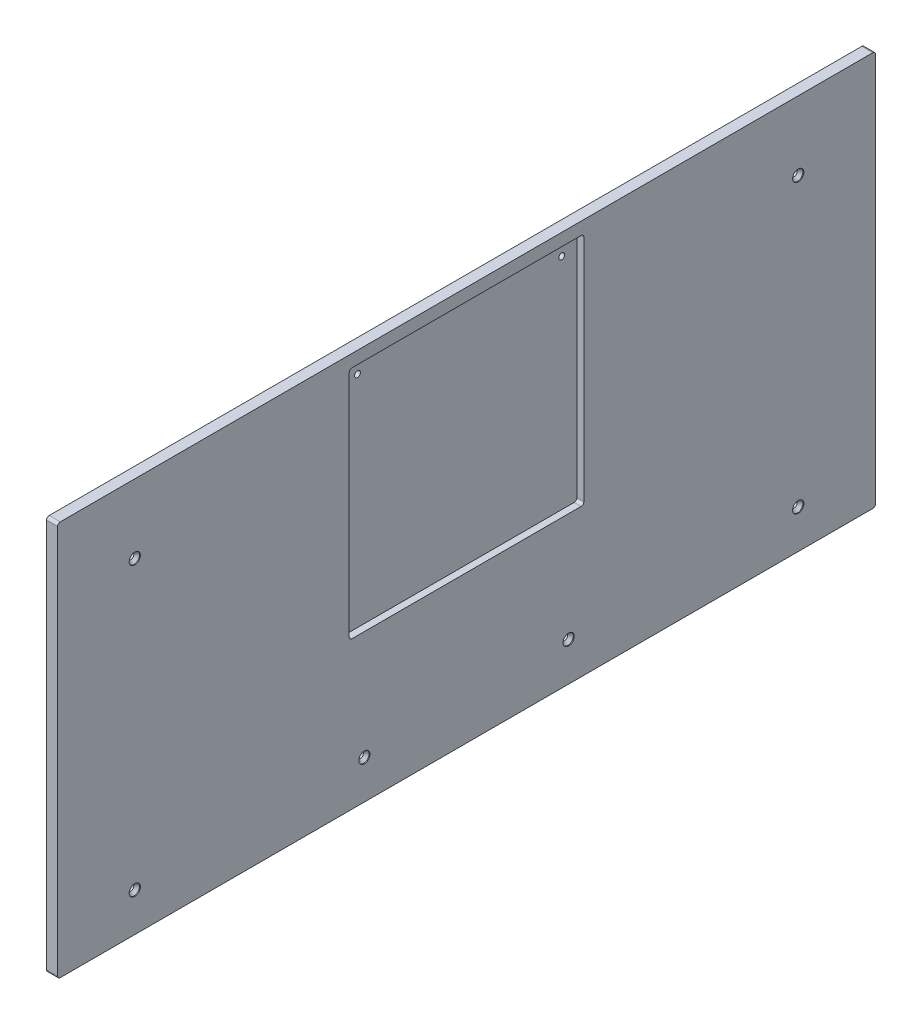
ISO-10303-21;
HEADER;
FILE_DESCRIPTION(('STEP AP214'),'2;1');
FILE_NAME('part.step','',(''),(''),'','','');
FILE_SCHEMA(('AUTOMOTIVE_DESIGN { 1 0 10303 214 1 1 1 1 }'));
ENDSEC;
DATA;
#1=APPLICATION_CONTEXT('core data for automotive mechanical design processes');
#2=APPLICATION_PROTOCOL_DEFINITION('international standard','automotive_design',2000,#1);
#3=PRODUCT_CONTEXT('',#1,'mechanical');
#4=PRODUCT('Part','Part','',(#3));
#5=PRODUCT_RELATED_PRODUCT_CATEGORY('part','',(#4));
#6=PRODUCT_DEFINITION_FORMATION('','',#4);
#7=PRODUCT_DEFINITION_CONTEXT('part definition',#1,'design');
#8=PRODUCT_DEFINITION('design','',#6,#7);
#9=PRODUCT_DEFINITION_SHAPE('','',#8);
#10=(LENGTH_UNIT() NAMED_UNIT(*) SI_UNIT(.MILLI.,.METRE.));
#11=(NAMED_UNIT(*) PLANE_ANGLE_UNIT() SI_UNIT($,.RADIAN.));
#12=(NAMED_UNIT(*) SI_UNIT($,.STERADIAN.) SOLID_ANGLE_UNIT());
#13=UNCERTAINTY_MEASURE_WITH_UNIT(LENGTH_MEASURE(1.E-05),#10,'distance_accuracy_value','');
#14=(GEOMETRIC_REPRESENTATION_CONTEXT(3) GLOBAL_UNCERTAINTY_ASSIGNED_CONTEXT((#13)) GLOBAL_UNIT_ASSIGNED_CONTEXT((#10,
#11,#12)) REPRESENTATION_CONTEXT('',''));
#15=CARTESIAN_POINT('',(0.,0.,0.));
#16=DIRECTION('',(0.,0.,1.));
#17=DIRECTION('',(1.,0.,0.));
#18=AXIS2_PLACEMENT_3D('',#15,#16,#17);
#19=CARTESIAN_POINT('',(0.,0.,0.));
#20=DIRECTION('',(-1.,0.,0.));
#21=DIRECTION('',(0.,0.,1.));
#22=AXIS2_PLACEMENT_3D('',#19,#20,#21);
#23=PLANE('',#22);
#24=CARTESIAN_POINT('',(0.,374.65,-88.9));
#25=DIRECTION('',(1.,0.,0.));
#26=DIRECTION('',(0.,0.,-1.));
#27=AXIS2_PLACEMENT_3D('',#24,#25,#26);
#28=CIRCLE('',#27,3.3782);
#29=CARTESIAN_POINT('',(0.,374.65,-92.2782));
#30=VERTEX_POINT('',#29);
#31=EDGE_CURVE('E512',#30,#30,#28,.T.);
#32=ORIENTED_EDGE('',*,*,#31,.T.);
#33=EDGE_LOOP('',(#32));
#34=FACE_BOUND('',#33,.T.);
#35=CARTESIAN_POINT('',(0.,374.65,-851.98204));
#36=DIRECTION('',(1.,0.,0.));
#37=DIRECTION('',(0.,0.,-1.));
#38=AXIS2_PLACEMENT_3D('',#35,#36,#37);
#39=CIRCLE('',#38,3.3782);
#40=CARTESIAN_POINT('',(0.,374.65,-855.36024));
#41=VERTEX_POINT('',#40);
#42=EDGE_CURVE('E527',#41,#41,#39,.T.);
#43=ORIENTED_EDGE('',*,*,#42,.T.);
#44=EDGE_LOOP('',(#43));
#45=FACE_BOUND('',#44,.T.);
#46=CARTESIAN_POINT('',(0.,44.45,-88.9));
#47=DIRECTION('',(1.,0.,0.));
#48=DIRECTION('',(0.,0.,-1.));
#49=AXIS2_PLACEMENT_3D('',#46,#47,#48);
#50=CIRCLE('',#49,3.3782);
#51=CARTESIAN_POINT('',(0.,44.45,-92.2782));
#52=VERTEX_POINT('',#51);
#53=EDGE_CURVE('E543',#52,#52,#50,.T.);
#54=ORIENTED_EDGE('',*,*,#53,.T.);
#55=EDGE_LOOP('',(#54));
#56=FACE_BOUND('',#55,.T.);
#57=CARTESIAN_POINT('',(0.,44.45,-352.96602));
#58=DIRECTION('',(1.,0.,0.));
#59=DIRECTION('',(0.,0.,-1.));
#60=AXIS2_PLACEMENT_3D('',#57,#58,#59);
#61=CIRCLE('',#60,3.3782);
#62=CARTESIAN_POINT('',(0.,44.45,-356.34422));
#63=VERTEX_POINT('',#62);
#64=EDGE_CURVE('E559',#63,#63,#61,.T.);
#65=ORIENTED_EDGE('',*,*,#64,.T.);
#66=EDGE_LOOP('',(#65));
#67=FACE_BOUND('',#66,.T.);
#68=CARTESIAN_POINT('',(0.,422.275,-587.91602));
#69=DIRECTION('',(1.,0.,0.));
#70=DIRECTION('',(0.,0.,-1.));
#71=AXIS2_PLACEMENT_3D('',#68,#69,#70);
#72=CIRCLE('',#71,3.37343749999991);
#73=CARTESIAN_POINT('',(0.,422.275,-591.2894575));
#74=VERTEX_POINT('',#73);
#75=EDGE_CURVE('E341',#74,#74,#72,.T.);
#76=ORIENTED_EDGE('',*,*,#75,.T.);
#77=EDGE_LOOP('',(#76));
#78=FACE_BOUND('',#77,.T.);
#79=DIRECTION('',(0.,0.,1.));
#80=VECTOR('',#79,1.);
#81=CARTESIAN_POINT('',(0.,454.025,0.));
#82=LINE('',#81,#80);
#83=CARTESIAN_POINT('',(0.,454.025,-937.70704));
#84=VERTEX_POINT('',#83);
#85=CARTESIAN_POINT('',(0.,454.025,-3.175));
#86=VERTEX_POINT('',#85);
#87=EDGE_CURVE('E172',#84,#86,#82,.T.);
#88=ORIENTED_EDGE('',*,*,#87,.F.);
#89=CARTESIAN_POINT('',(0.,450.85,-937.70704));
#90=DIRECTION('',(-1.,0.,0.));
#91=DIRECTION('',(0.,0.,1.));
#92=AXIS2_PLACEMENT_3D('',#89,#90,#91);
#93=CIRCLE('',#92,3.175);
#94=CARTESIAN_POINT('',(0.,450.85,-940.88204));
#95=VERTEX_POINT('',#94);
#96=EDGE_CURVE('E154',#84,#95,#93,.T.);
#97=ORIENTED_EDGE('',*,*,#96,.T.);
#98=DIRECTION('',(0.,1.,0.));
#99=VECTOR('',#98,1.);
#100=CARTESIAN_POINT('',(0.,0.,-940.88204));
#101=LINE('',#100,#99);
#102=CARTESIAN_POINT('',(0.,3.175,-940.88204));
#103=VERTEX_POINT('',#102);
#104=EDGE_CURVE('E184',#103,#95,#101,.T.);
#105=ORIENTED_EDGE('',*,*,#104,.F.);
#106=CARTESIAN_POINT('',(0.,3.175,-937.70704));
#107=DIRECTION('',(-1.,0.,0.));
#108=DIRECTION('',(0.,0.,1.));
#109=AXIS2_PLACEMENT_3D('',#106,#107,#108);
#110=CIRCLE('',#109,3.175);
#111=CARTESIAN_POINT('',(0.,0.,-937.70704));
#112=VERTEX_POINT('',#111);
#113=EDGE_CURVE('E166',#103,#112,#110,.T.);
#114=ORIENTED_EDGE('',*,*,#113,.T.);
#115=DIRECTION('',(0.,0.,-1.));
#116=VECTOR('',#115,1.);
#117=CARTESIAN_POINT('',(0.,0.,0.));
#118=LINE('',#117,#116);
#119=CARTESIAN_POINT('',(0.,0.,-3.175));
#120=VERTEX_POINT('',#119);
#121=EDGE_CURVE('E192',#120,#112,#118,.T.);
#122=ORIENTED_EDGE('',*,*,#121,.F.);
#123=CARTESIAN_POINT('',(0.,3.175,-3.175));
#124=DIRECTION('',(-1.,0.,0.));
#125=DIRECTION('',(0.,0.,1.));
#126=AXIS2_PLACEMENT_3D('',#123,#124,#125);
#127=CIRCLE('',#126,3.175);
#128=CARTESIAN_POINT('',(0.,3.175,0.));
#129=VERTEX_POINT('',#128);
#130=EDGE_CURVE('E200',#120,#129,#127,.T.);
#131=ORIENTED_EDGE('',*,*,#130,.T.);
#132=DIRECTION('',(0.,-1.,0.));
#133=VECTOR('',#132,1.);
#134=CARTESIAN_POINT('',(0.,0.,0.));
#135=LINE('',#134,#133);
#136=CARTESIAN_POINT('',(0.,450.85,0.));
#137=VERTEX_POINT('',#136);
#138=EDGE_CURVE('E348',#137,#129,#135,.T.);
#139=ORIENTED_EDGE('',*,*,#138,.F.);
#140=CARTESIAN_POINT('',(0.,450.85,-3.175));
#141=DIRECTION('',(-1.,0.,0.));
#142=DIRECTION('',(0.,0.,1.));
#143=AXIS2_PLACEMENT_3D('',#140,#141,#142);
#144=CIRCLE('',#143,3.175);
#145=EDGE_CURVE('E177',#137,#86,#144,.T.);
#146=ORIENTED_EDGE('',*,*,#145,.T.);
#147=EDGE_LOOP('',(#88,#97,#105,#114,#122,#131,#139,#146));
#148=FACE_BOUND('',#147,.T.);
#149=CARTESIAN_POINT('',(0.,422.275,-352.96602));
#150=DIRECTION('',(1.,0.,0.));
#151=DIRECTION('',(0.,0.,-1.));
#152=AXIS2_PLACEMENT_3D('',#149,#150,#151);
#153=CIRCLE('',#152,3.37343750000003);
#154=CARTESIAN_POINT('',(0.,422.275,-356.3394575));
#155=VERTEX_POINT('',#154);
#156=EDGE_CURVE('E345',#155,#155,#153,.T.);
#157=ORIENTED_EDGE('',*,*,#156,.T.);
#158=EDGE_LOOP('',(#157));
#159=FACE_BOUND('',#158,.T.);
#160=CARTESIAN_POINT('',(0.,44.45,-851.98204));
#161=DIRECTION('',(1.,0.,0.));
#162=DIRECTION('',(0.,0.,-1.));
#163=AXIS2_PLACEMENT_3D('',#160,#161,#162);
#164=CIRCLE('',#163,3.3782);
#165=CARTESIAN_POINT('',(0.,44.45,-855.36024));
#166=VERTEX_POINT('',#165);
#167=EDGE_CURVE('E300',#166,#166,#164,.T.);
#168=ORIENTED_EDGE('',*,*,#167,.T.);
#169=EDGE_LOOP('',(#168));
#170=FACE_BOUND('',#169,.T.);
#171=CARTESIAN_POINT('',(0.,44.45,-587.91602));
#172=DIRECTION('',(1.,0.,0.));
#173=DIRECTION('',(0.,0.,-1.));
#174=AXIS2_PLACEMENT_3D('',#171,#172,#173);
#175=CIRCLE('',#174,3.3782);
#176=CARTESIAN_POINT('',(0.,44.45,-591.29422));
#177=VERTEX_POINT('',#176);
#178=EDGE_CURVE('E575',#177,#177,#175,.T.);
#179=ORIENTED_EDGE('',*,*,#178,.T.);
#180=EDGE_LOOP('',(#179));
#181=FACE_BOUND('',#180,.T.);
#182=ADVANCED_FACE('F41',(#34,#45,#56,#67,#78,#148,#159,#170,#181),#23,.T.);
#183=CARTESIAN_POINT('',(12.7,422.275,-352.96602));
#184=DIRECTION('',(-1.,0.,0.));
#185=DIRECTION('',(0.,0.,1.));
#186=AXIS2_PLACEMENT_3D('',#183,#184,#185);
#187=CYLINDRICAL_SURFACE('',#186,3.37343750000003);
#188=ORIENTED_EDGE('',*,*,#156,.F.);
#189=EDGE_LOOP('',(#188));
#190=FACE_BOUND('',#189,.T.);
#191=CARTESIAN_POINT('',(4.7625,422.275,-352.96602));
#192=DIRECTION('',(1.,0.,0.));
#193=DIRECTION('',(0.,0.,-1.));
#194=AXIS2_PLACEMENT_3D('',#191,#192,#193);
#195=CIRCLE('',#194,3.37343750000003);
#196=CARTESIAN_POINT('',(4.7625,422.275,-356.3394575));
#197=VERTEX_POINT('',#196);
#198=EDGE_CURVE('E241',#197,#197,#195,.T.);
#199=ORIENTED_EDGE('',*,*,#198,.T.);
#200=EDGE_LOOP('',(#199));
#201=FACE_BOUND('',#200,.T.);
#202=ADVANCED_FACE('F387',(#190,#201),#187,.F.);
#203=CARTESIAN_POINT('',(12.7,422.275,-587.91602));
#204=DIRECTION('',(-1.,0.,0.));
#205=DIRECTION('',(0.,0.,1.));
#206=AXIS2_PLACEMENT_3D('',#203,#204,#205);
#207=CYLINDRICAL_SURFACE('',#206,3.37343749999991);
#208=ORIENTED_EDGE('',*,*,#75,.F.);
#209=EDGE_LOOP('',(#208));
#210=FACE_BOUND('',#209,.T.);
#211=CARTESIAN_POINT('',(4.7625,422.275,-587.91602));
#212=DIRECTION('',(1.,0.,0.));
#213=DIRECTION('',(0.,0.,-1.));
#214=AXIS2_PLACEMENT_3D('',#211,#212,#213);
#215=CIRCLE('',#214,3.37343749999991);
#216=CARTESIAN_POINT('',(4.7625,422.275,-591.2894575));
#217=VERTEX_POINT('',#216);
#218=EDGE_CURVE('E237',#217,#217,#215,.T.);
#219=ORIENTED_EDGE('',*,*,#218,.T.);
#220=EDGE_LOOP('',(#219));
#221=FACE_BOUND('',#220,.T.);
#222=ADVANCED_FACE('F393',(#210,#221),#207,.F.);
#223=CARTESIAN_POINT('',(12.7,0.,0.));
#224=DIRECTION('',(-1.,0.,0.));
#225=DIRECTION('',(0.,0.,1.));
#226=AXIS2_PLACEMENT_3D('',#223,#224,#225);
#227=PLANE('',#226);
#228=CARTESIAN_POINT('',(12.7,374.65,-88.9));
#229=DIRECTION('',(1.,0.,0.));
#230=DIRECTION('',(0.,0.,-1.));
#231=AXIS2_PLACEMENT_3D('',#228,#229,#230);
#232=CIRCLE('',#231,6.43890000000003);
#233=CARTESIAN_POINT('',(12.7,374.65,-95.3389));
#234=VERTEX_POINT('',#233);
#235=EDGE_CURVE('E501',#234,#234,#232,.T.);
#236=ORIENTED_EDGE('',*,*,#235,.F.);
#237=EDGE_LOOP('',(#236));
#238=FACE_BOUND('',#237,.T.);
#239=CARTESIAN_POINT('',(12.7,374.65,-851.98204));
#240=DIRECTION('',(1.,0.,0.));
#241=DIRECTION('',(0.,0.,-1.));
#242=AXIS2_PLACEMENT_3D('',#239,#240,#241);
#243=CIRCLE('',#242,6.43890000000003);
#244=CARTESIAN_POINT('',(12.7,374.65,-858.42094));
#245=VERTEX_POINT('',#244);
#246=EDGE_CURVE('E515',#245,#245,#243,.T.);
#247=ORIENTED_EDGE('',*,*,#246,.F.);
#248=EDGE_LOOP('',(#247));
#249=FACE_BOUND('',#248,.T.);
#250=CARTESIAN_POINT('',(12.7,44.45,-88.9));
#251=DIRECTION('',(1.,0.,0.));
#252=DIRECTION('',(0.,0.,-1.));
#253=AXIS2_PLACEMENT_3D('',#250,#251,#252);
#254=CIRCLE('',#253,6.4389);
#255=CARTESIAN_POINT('',(12.7,44.45,-95.3389));
#256=VERTEX_POINT('',#255);
#257=EDGE_CURVE('E531',#256,#256,#254,.T.);
#258=ORIENTED_EDGE('',*,*,#257,.F.);
#259=EDGE_LOOP('',(#258));
#260=FACE_BOUND('',#259,.T.);
#261=CARTESIAN_POINT('',(12.7,44.45,-352.96602));
#262=DIRECTION('',(1.,0.,0.));
#263=DIRECTION('',(0.,0.,-1.));
#264=AXIS2_PLACEMENT_3D('',#261,#262,#263);
#265=CIRCLE('',#264,6.4389);
#266=CARTESIAN_POINT('',(12.7,44.45,-359.40492));
#267=VERTEX_POINT('',#266);
#268=EDGE_CURVE('E547',#267,#267,#265,.T.);
#269=ORIENTED_EDGE('',*,*,#268,.F.);
#270=EDGE_LOOP('',(#269));
#271=FACE_BOUND('',#270,.T.);
#272=CARTESIAN_POINT('',(12.7,44.45,-587.91602));
#273=DIRECTION('',(1.,0.,0.));
#274=DIRECTION('',(0.,0.,-1.));
#275=AXIS2_PLACEMENT_3D('',#272,#273,#274);
#276=CIRCLE('',#275,6.4389);
#277=CARTESIAN_POINT('',(12.7,44.45,-594.35492));
#278=VERTEX_POINT('',#277);
#279=EDGE_CURVE('E563',#278,#278,#276,.T.);
#280=ORIENTED_EDGE('',*,*,#279,.F.);
#281=EDGE_LOOP('',(#280));
#282=FACE_BOUND('',#281,.T.);
#283=CARTESIAN_POINT('',(12.7,44.45,-851.98204));
#284=DIRECTION('',(1.,0.,0.));
#285=DIRECTION('',(0.,0.,-1.));
#286=AXIS2_PLACEMENT_3D('',#283,#284,#285);
#287=CIRCLE('',#286,6.4389);
#288=CARTESIAN_POINT('',(12.7,44.45,-858.42094));
#289=VERTEX_POINT('',#288);
#290=EDGE_CURVE('E579',#289,#289,#287,.T.);
#291=ORIENTED_EDGE('',*,*,#290,.F.);
#292=EDGE_LOOP('',(#291));
#293=FACE_BOUND('',#292,.T.);
#294=DIRECTION('',(0.,0.,-1.));
#295=VECTOR('',#294,1.);
#296=CARTESIAN_POINT('',(12.7,169.8625,-335.50352));
#297=LINE('',#296,#295);
#298=CARTESIAN_POINT('',(12.7,169.8625,-338.67852));
#299=VERTEX_POINT('',#298);
#300=CARTESIAN_POINT('',(12.7,169.8625,-602.20352));
#301=VERTEX_POINT('',#300);
#302=EDGE_CURVE('E293',#299,#301,#297,.T.);
#303=ORIENTED_EDGE('',*,*,#302,.F.);
#304=CARTESIAN_POINT('',(12.7,173.0375,-338.67852));
#305=DIRECTION('',(-1.,0.,0.));
#306=DIRECTION('',(0.,0.,1.));
#307=AXIS2_PLACEMENT_3D('',#304,#305,#306);
#308=CIRCLE('',#307,3.175);
#309=CARTESIAN_POINT('',(12.7,173.0375,-335.50352));
#310=VERTEX_POINT('',#309);
#311=EDGE_CURVE('E50',#299,#310,#308,.T.);
#312=ORIENTED_EDGE('',*,*,#311,.T.);
#313=DIRECTION('',(0.,-1.,0.));
#314=VECTOR('',#313,1.);
#315=CARTESIAN_POINT('',(12.7,439.7375,-335.50352));
#316=LINE('',#315,#314);
#317=CARTESIAN_POINT('',(12.7,436.5625,-335.50352));
#318=VERTEX_POINT('',#317);
#319=EDGE_CURVE('E292',#318,#310,#316,.T.);
#320=ORIENTED_EDGE('',*,*,#319,.F.);
#321=CARTESIAN_POINT('',(12.7,436.5625,-338.67852));
#322=DIRECTION('',(-1.,0.,0.));
#323=DIRECTION('',(0.,0.,1.));
#324=AXIS2_PLACEMENT_3D('',#321,#322,#323);
#325=CIRCLE('',#324,3.175);
#326=CARTESIAN_POINT('',(12.7,439.7375,-338.67852));
#327=VERTEX_POINT('',#326);
#328=EDGE_CURVE('E281',#318,#327,#325,.T.);
#329=ORIENTED_EDGE('',*,*,#328,.T.);
#330=DIRECTION('',(0.,0.,1.));
#331=VECTOR('',#330,1.);
#332=CARTESIAN_POINT('',(12.7,439.7375,-335.50352));
#333=LINE('',#332,#331);
#334=CARTESIAN_POINT('',(12.7,439.7375,-602.20352));
#335=VERTEX_POINT('',#334);
#336=EDGE_CURVE('E323',#335,#327,#333,.T.);
#337=ORIENTED_EDGE('',*,*,#336,.F.);
#338=CARTESIAN_POINT('',(12.7,436.5625,-602.20352));
#339=DIRECTION('',(-1.,0.,0.));
#340=DIRECTION('',(0.,0.,1.));
#341=AXIS2_PLACEMENT_3D('',#338,#339,#340);
#342=CIRCLE('',#341,3.175);
#343=CARTESIAN_POINT('',(12.7,436.5625,-605.37852));
#344=VERTEX_POINT('',#343);
#345=EDGE_CURVE('E284',#335,#344,#342,.T.);
#346=ORIENTED_EDGE('',*,*,#345,.T.);
#347=DIRECTION('',(0.,1.,0.));
#348=VECTOR('',#347,1.);
#349=CARTESIAN_POINT('',(12.7,439.7375,-605.37852));
#350=LINE('',#349,#348);
#351=CARTESIAN_POINT('',(12.7,173.0375,-605.37852));
#352=VERTEX_POINT('',#351);
#353=EDGE_CURVE('E331',#352,#344,#350,.T.);
#354=ORIENTED_EDGE('',*,*,#353,.F.);
#355=CARTESIAN_POINT('',(12.7,173.0375,-602.20352));
#356=DIRECTION('',(-1.,0.,0.));
#357=DIRECTION('',(0.,0.,1.));
#358=AXIS2_PLACEMENT_3D('',#355,#356,#357);
#359=CIRCLE('',#358,3.175);
#360=EDGE_CURVE('E11',#352,#301,#359,.T.);
#361=ORIENTED_EDGE('',*,*,#360,.T.);
#362=EDGE_LOOP('',(#303,#312,#320,#329,#337,#346,#354,#361));
#363=FACE_BOUND('',#362,.T.);
#364=DIRECTION('',(0.,1.,0.));
#365=VECTOR('',#364,1.);
#366=CARTESIAN_POINT('',(12.7,0.,-940.88204));
#367=LINE('',#366,#365);
#368=CARTESIAN_POINT('',(12.7,3.175,-940.88204));
#369=VERTEX_POINT('',#368);
#370=CARTESIAN_POINT('',(12.7,450.85,-940.88204));
#371=VERTEX_POINT('',#370);
#372=EDGE_CURVE('E353',#369,#371,#367,.T.);
#373=ORIENTED_EDGE('',*,*,#372,.T.);
#374=CARTESIAN_POINT('',(12.7,450.85,-937.70704));
#375=DIRECTION('',(-1.,0.,0.));
#376=DIRECTION('',(0.,0.,1.));
#377=AXIS2_PLACEMENT_3D('',#374,#375,#376);
#378=CIRCLE('',#377,3.175);
#379=CARTESIAN_POINT('',(12.7,454.025,-937.70704));
#380=VERTEX_POINT('',#379);
#381=EDGE_CURVE('E219',#371,#380,#378,.F.);
#382=ORIENTED_EDGE('',*,*,#381,.T.);
#383=DIRECTION('',(0.,0.,1.));
#384=VECTOR('',#383,1.);
#385=CARTESIAN_POINT('',(12.7,454.025,0.));
#386=LINE('',#385,#384);
#387=CARTESIAN_POINT('',(12.7,454.025,-3.175));
#388=VERTEX_POINT('',#387);
#389=EDGE_CURVE('E175',#380,#388,#386,.T.);
#390=ORIENTED_EDGE('',*,*,#389,.T.);
#391=CARTESIAN_POINT('',(12.7,450.85,-3.175));
#392=DIRECTION('',(-1.,0.,0.));
#393=DIRECTION('',(0.,0.,1.));
#394=AXIS2_PLACEMENT_3D('',#391,#392,#393);
#395=CIRCLE('',#394,3.175);
#396=CARTESIAN_POINT('',(12.7,450.85,0.));
#397=VERTEX_POINT('',#396);
#398=EDGE_CURVE('E210',#388,#397,#395,.F.);
#399=ORIENTED_EDGE('',*,*,#398,.T.);
#400=DIRECTION('',(0.,-1.,0.));
#401=VECTOR('',#400,1.);
#402=CARTESIAN_POINT('',(12.7,0.,0.));
#403=LINE('',#402,#401);
#404=CARTESIAN_POINT('',(12.7,3.175,0.));
#405=VERTEX_POINT('',#404);
#406=EDGE_CURVE('E183',#397,#405,#403,.T.);
#407=ORIENTED_EDGE('',*,*,#406,.T.);
#408=CARTESIAN_POINT('',(12.7,3.175,-3.175));
#409=DIRECTION('',(-1.,0.,0.));
#410=DIRECTION('',(0.,0.,1.));
#411=AXIS2_PLACEMENT_3D('',#408,#409,#410);
#412=CIRCLE('',#411,3.175);
#413=CARTESIAN_POINT('',(12.7,0.,-3.175));
#414=VERTEX_POINT('',#413);
#415=EDGE_CURVE('E213',#405,#414,#412,.F.);
#416=ORIENTED_EDGE('',*,*,#415,.T.);
#417=DIRECTION('',(0.,0.,-1.));
#418=VECTOR('',#417,1.);
#419=CARTESIAN_POINT('',(12.7,0.,0.));
#420=LINE('',#419,#418);
#421=CARTESIAN_POINT('',(12.7,0.,-937.70704));
#422=VERTEX_POINT('',#421);
#423=EDGE_CURVE('E190',#414,#422,#420,.T.);
#424=ORIENTED_EDGE('',*,*,#423,.T.);
#425=CARTESIAN_POINT('',(12.7,3.175,-937.70704));
#426=DIRECTION('',(-1.,0.,0.));
#427=DIRECTION('',(0.,0.,1.));
#428=AXIS2_PLACEMENT_3D('',#425,#426,#427);
#429=CIRCLE('',#428,3.175);
#430=EDGE_CURVE('E216',#422,#369,#429,.F.);
#431=ORIENTED_EDGE('',*,*,#430,.T.);
#432=EDGE_LOOP('',(#373,#382,#390,#399,#407,#416,#424,#431));
#433=FACE_BOUND('',#432,.T.);
#434=ADVANCED_FACE('F290',(#238,#249,#260,#271,#282,#293,#363,#433),#227,.F.);
#435=CARTESIAN_POINT('',(12.7,0.,0.));
#436=DIRECTION('',(0.,0.,-1.));
#437=DIRECTION('',(-1.,0.,0.));
#438=AXIS2_PLACEMENT_3D('',#435,#436,#437);
#439=PLANE('',#438);
#440=ORIENTED_EDGE('',*,*,#138,.T.);
#441=DIRECTION('',(-1.,0.,0.));
#442=VECTOR('',#441,1.);
#443=CARTESIAN_POINT('',(12.7,3.175,0.));
#444=LINE('',#443,#442);
#445=EDGE_CURVE('E233',#129,#405,#444,.F.);
#446=ORIENTED_EDGE('',*,*,#445,.T.);
#447=ORIENTED_EDGE('',*,*,#406,.F.);
#448=DIRECTION('',(-1.,0.,0.));
#449=VECTOR('',#448,1.);
#450=CARTESIAN_POINT('',(12.7,450.85,0.));
#451=LINE('',#450,#449);
#452=EDGE_CURVE('E229',#397,#137,#451,.T.);
#453=ORIENTED_EDGE('',*,*,#452,.T.);
#454=EDGE_LOOP('',(#440,#446,#447,#453));
#455=FACE_BOUND('',#454,.T.);
#456=ADVANCED_FACE('F384',(#455),#439,.F.);
#457=CARTESIAN_POINT('',(12.7,0.,0.));
#458=DIRECTION('',(0.,1.,0.));
#459=DIRECTION('',(0.,0.,1.));
#460=AXIS2_PLACEMENT_3D('',#457,#458,#459);
#461=PLANE('',#460);
#462=ORIENTED_EDGE('',*,*,#121,.T.);
#463=DIRECTION('',(-1.,0.,0.));
#464=VECTOR('',#463,1.);
#465=CARTESIAN_POINT('',(12.7,0.,-937.70704));
#466=LINE('',#465,#464);
#467=EDGE_CURVE('E226',#112,#422,#466,.F.);
#468=ORIENTED_EDGE('',*,*,#467,.T.);
#469=ORIENTED_EDGE('',*,*,#423,.F.);
#470=DIRECTION('',(-1.,0.,0.));
#471=VECTOR('',#470,1.);
#472=CARTESIAN_POINT('',(12.7,0.,-3.175));
#473=LINE('',#472,#471);
#474=EDGE_CURVE('E222',#414,#120,#473,.T.);
#475=ORIENTED_EDGE('',*,*,#474,.T.);
#476=EDGE_LOOP('',(#462,#468,#469,#475));
#477=FACE_BOUND('',#476,.T.);
#478=ADVANCED_FACE('F367',(#477),#461,.F.);
#479=CARTESIAN_POINT('',(12.7,0.,-940.88204));
#480=DIRECTION('',(0.,0.,1.));
#481=DIRECTION('',(1.,0.,0.));
#482=AXIS2_PLACEMENT_3D('',#479,#480,#481);
#483=PLANE('',#482);
#484=ORIENTED_EDGE('',*,*,#104,.T.);
#485=DIRECTION('',(-1.,0.,0.));
#486=VECTOR('',#485,1.);
#487=CARTESIAN_POINT('',(12.7,450.85,-940.88204));
#488=LINE('',#487,#486);
#489=EDGE_CURVE('E159',#95,#371,#488,.F.);
#490=ORIENTED_EDGE('',*,*,#489,.T.);
#491=ORIENTED_EDGE('',*,*,#372,.F.);
#492=DIRECTION('',(-1.,0.,0.));
#493=VECTOR('',#492,1.);
#494=CARTESIAN_POINT('',(12.7,3.175,-940.88204));
#495=LINE('',#494,#493);
#496=EDGE_CURVE('E165',#369,#103,#495,.T.);
#497=ORIENTED_EDGE('',*,*,#496,.T.);
#498=EDGE_LOOP('',(#484,#490,#491,#497));
#499=FACE_BOUND('',#498,.T.);
#500=ADVANCED_FACE('F376',(#499),#483,.F.);
#501=CARTESIAN_POINT('',(12.7,454.025,0.));
#502=DIRECTION('',(0.,-1.,0.));
#503=DIRECTION('',(0.,0.,-1.));
#504=AXIS2_PLACEMENT_3D('',#501,#502,#503);
#505=PLANE('',#504);
#506=ORIENTED_EDGE('',*,*,#389,.F.);
#507=DIRECTION('',(-1.,0.,0.));
#508=VECTOR('',#507,1.);
#509=CARTESIAN_POINT('',(12.7,454.025,-937.70704));
#510=LINE('',#509,#508);
#511=EDGE_CURVE('E158',#380,#84,#510,.T.);
#512=ORIENTED_EDGE('',*,*,#511,.T.);
#513=ORIENTED_EDGE('',*,*,#87,.T.);
#514=DIRECTION('',(-1.,0.,0.));
#515=VECTOR('',#514,1.);
#516=CARTESIAN_POINT('',(12.7,454.025,-3.175));
#517=LINE('',#516,#515);
#518=EDGE_CURVE('E178',#86,#388,#517,.F.);
#519=ORIENTED_EDGE('',*,*,#518,.T.);
#520=EDGE_LOOP('',(#506,#512,#513,#519));
#521=FACE_BOUND('',#520,.T.);
#522=ADVANCED_FACE('F171',(#521),#505,.F.);
#523=CARTESIAN_POINT('',(12.7,450.85,-937.70704));
#524=DIRECTION('',(-1.,0.,0.));
#525=DIRECTION('',(0.,0.,1.));
#526=AXIS2_PLACEMENT_3D('',#523,#524,#525);
#527=CYLINDRICAL_SURFACE('',#526,3.175);
#528=ORIENTED_EDGE('',*,*,#381,.F.);
#529=ORIENTED_EDGE('',*,*,#489,.F.);
#530=ORIENTED_EDGE('',*,*,#96,.F.);
#531=ORIENTED_EDGE('',*,*,#511,.F.);
#532=EDGE_LOOP('',(#528,#529,#530,#531));
#533=FACE_BOUND('',#532,.T.);
#534=ADVANCED_FACE('F157',(#533),#527,.T.);
#535=CARTESIAN_POINT('',(12.7,3.175,-937.70704));
#536=DIRECTION('',(-1.,0.,0.));
#537=DIRECTION('',(0.,0.,1.));
#538=AXIS2_PLACEMENT_3D('',#535,#536,#537);
#539=CYLINDRICAL_SURFACE('',#538,3.175);
#540=ORIENTED_EDGE('',*,*,#430,.F.);
#541=ORIENTED_EDGE('',*,*,#467,.F.);
#542=ORIENTED_EDGE('',*,*,#113,.F.);
#543=ORIENTED_EDGE('',*,*,#496,.F.);
#544=EDGE_LOOP('',(#540,#541,#542,#543));
#545=FACE_BOUND('',#544,.T.);
#546=ADVANCED_FACE('F372',(#545),#539,.T.);
#547=CARTESIAN_POINT('',(12.7,3.175,-3.175));
#548=DIRECTION('',(-1.,0.,0.));
#549=DIRECTION('',(0.,0.,1.));
#550=AXIS2_PLACEMENT_3D('',#547,#548,#549);
#551=CYLINDRICAL_SURFACE('',#550,3.175);
#552=ORIENTED_EDGE('',*,*,#415,.F.);
#553=ORIENTED_EDGE('',*,*,#445,.F.);
#554=ORIENTED_EDGE('',*,*,#130,.F.);
#555=ORIENTED_EDGE('',*,*,#474,.F.);
#556=EDGE_LOOP('',(#552,#553,#554,#555));
#557=FACE_BOUND('',#556,.T.);
#558=ADVANCED_FACE('F795',(#557),#551,.T.);
#559=CARTESIAN_POINT('',(12.7,450.85,-3.175));
#560=DIRECTION('',(-1.,0.,0.));
#561=DIRECTION('',(0.,0.,1.));
#562=AXIS2_PLACEMENT_3D('',#559,#560,#561);
#563=CYLINDRICAL_SURFACE('',#562,3.175);
#564=ORIENTED_EDGE('',*,*,#398,.F.);
#565=ORIENTED_EDGE('',*,*,#518,.F.);
#566=ORIENTED_EDGE('',*,*,#145,.F.);
#567=ORIENTED_EDGE('',*,*,#452,.F.);
#568=EDGE_LOOP('',(#564,#565,#566,#567));
#569=FACE_BOUND('',#568,.T.);
#570=ADVANCED_FACE('F408',(#569),#563,.T.);
#571=CARTESIAN_POINT('',(4.7625,439.7375,-335.50352));
#572=DIRECTION('',(0.,0.,1.));
#573=DIRECTION('',(0.,-1.,0.));
#574=AXIS2_PLACEMENT_3D('',#571,#572,#573);
#575=PLANE('',#574);
#576=DIRECTION('',(0.,-1.,0.));
#577=VECTOR('',#576,1.);
#578=CARTESIAN_POINT('',(4.7625,439.7375,-335.50352));
#579=LINE('',#578,#577);
#580=CARTESIAN_POINT('',(4.7625,436.5625,-335.50352));
#581=VERTEX_POINT('',#580);
#582=CARTESIAN_POINT('',(4.7625,173.0375,-335.50352));
#583=VERTEX_POINT('',#582);
#584=EDGE_CURVE('E311',#581,#583,#579,.T.);
#585=ORIENTED_EDGE('',*,*,#584,.F.);
#586=DIRECTION('',(1.,0.,0.));
#587=VECTOR('',#586,1.);
#588=CARTESIAN_POINT('',(12.7,436.5625,-335.50352));
#589=LINE('',#588,#587);
#590=EDGE_CURVE('E245',#581,#318,#589,.T.);
#591=ORIENTED_EDGE('',*,*,#590,.T.);
#592=ORIENTED_EDGE('',*,*,#319,.T.);
#593=DIRECTION('',(1.,0.,0.));
#594=VECTOR('',#593,1.);
#595=CARTESIAN_POINT('',(4.7625,173.0375,-335.50352));
#596=LINE('',#595,#594);
#597=EDGE_CURVE('E236',#310,#583,#596,.F.);
#598=ORIENTED_EDGE('',*,*,#597,.T.);
#599=EDGE_LOOP('',(#585,#591,#592,#598));
#600=FACE_BOUND('',#599,.T.);
#601=ADVANCED_FACE('F296',(#600),#575,.F.);
#602=CARTESIAN_POINT('',(4.7625,439.7375,-335.50352));
#603=DIRECTION('',(0.,1.,0.));
#604=DIRECTION('',(0.,0.,1.));
#605=AXIS2_PLACEMENT_3D('',#602,#603,#604);
#606=PLANE('',#605);
#607=ORIENTED_EDGE('',*,*,#336,.T.);
#608=DIRECTION('',(1.,0.,0.));
#609=VECTOR('',#608,1.);
#610=CARTESIAN_POINT('',(4.7625,439.7375,-338.67852));
#611=LINE('',#610,#609);
#612=CARTESIAN_POINT('',(4.7625,439.7375,-338.67852));
#613=VERTEX_POINT('',#612);
#614=EDGE_CURVE('E253',#327,#613,#611,.F.);
#615=ORIENTED_EDGE('',*,*,#614,.T.);
#616=DIRECTION('',(0.,0.,1.));
#617=VECTOR('',#616,1.);
#618=CARTESIAN_POINT('',(4.7625,439.7375,-335.50352));
#619=LINE('',#618,#617);
#620=CARTESIAN_POINT('',(4.7625,439.7375,-602.20352));
#621=VERTEX_POINT('',#620);
#622=EDGE_CURVE('E242',#621,#613,#619,.T.);
#623=ORIENTED_EDGE('',*,*,#622,.F.);
#624=DIRECTION('',(1.,0.,0.));
#625=VECTOR('',#624,1.);
#626=CARTESIAN_POINT('',(12.7,439.7375,-602.20352));
#627=LINE('',#626,#625);
#628=EDGE_CURVE('E249',#621,#335,#627,.T.);
#629=ORIENTED_EDGE('',*,*,#628,.T.);
#630=EDGE_LOOP('',(#607,#615,#623,#629));
#631=FACE_BOUND('',#630,.T.);
#632=ADVANCED_FACE('F407',(#631),#606,.F.);
#633=CARTESIAN_POINT('',(4.7625,439.7375,-605.37852));
#634=DIRECTION('',(0.,0.,-1.));
#635=DIRECTION('',(-1.,0.,0.));
#636=AXIS2_PLACEMENT_3D('',#633,#634,#635);
#637=PLANE('',#636);
#638=ORIENTED_EDGE('',*,*,#353,.T.);
#639=DIRECTION('',(1.,0.,0.));
#640=VECTOR('',#639,1.);
#641=CARTESIAN_POINT('',(4.7625,436.5625,-605.37852));
#642=LINE('',#641,#640);
#643=CARTESIAN_POINT('',(4.7625,436.5625,-605.37852));
#644=VERTEX_POINT('',#643);
#645=EDGE_CURVE('E272',#344,#644,#642,.F.);
#646=ORIENTED_EDGE('',*,*,#645,.T.);
#647=DIRECTION('',(0.,1.,0.));
#648=VECTOR('',#647,1.);
#649=CARTESIAN_POINT('',(4.7625,439.7375,-605.37852));
#650=LINE('',#649,#648);
#651=CARTESIAN_POINT('',(4.7625,173.0375,-605.37852));
#652=VERTEX_POINT('',#651);
#653=EDGE_CURVE('E316',#652,#644,#650,.T.);
#654=ORIENTED_EDGE('',*,*,#653,.F.);
#655=DIRECTION('',(1.,0.,0.));
#656=VECTOR('',#655,1.);
#657=CARTESIAN_POINT('',(12.7,173.0375,-605.37852));
#658=LINE('',#657,#656);
#659=EDGE_CURVE('E268',#652,#352,#658,.T.);
#660=ORIENTED_EDGE('',*,*,#659,.T.);
#661=EDGE_LOOP('',(#638,#646,#654,#660));
#662=FACE_BOUND('',#661,.T.);
#663=ADVANCED_FACE('F411',(#662),#637,.F.);
#664=CARTESIAN_POINT('',(4.7625,169.8625,-335.50352));
#665=DIRECTION('',(0.,-1.,0.));
#666=DIRECTION('',(0.,0.,-1.));
#667=AXIS2_PLACEMENT_3D('',#664,#665,#666);
#668=PLANE('',#667);
#669=DIRECTION('',(0.,0.,-1.));
#670=VECTOR('',#669,1.);
#671=CARTESIAN_POINT('',(4.7625,169.8625,-335.50352));
#672=LINE('',#671,#670);
#673=CARTESIAN_POINT('',(4.7625,169.8625,-338.67852));
#674=VERTEX_POINT('',#673);
#675=CARTESIAN_POINT('',(4.7625,169.8625,-602.20352));
#676=VERTEX_POINT('',#675);
#677=EDGE_CURVE('E309',#674,#676,#672,.T.);
#678=ORIENTED_EDGE('',*,*,#677,.F.);
#679=DIRECTION('',(1.,0.,0.));
#680=VECTOR('',#679,1.);
#681=CARTESIAN_POINT('',(12.7,169.8625,-338.67852));
#682=LINE('',#681,#680);
#683=EDGE_CURVE('E278',#674,#299,#682,.T.);
#684=ORIENTED_EDGE('',*,*,#683,.T.);
#685=ORIENTED_EDGE('',*,*,#302,.T.);
#686=DIRECTION('',(1.,0.,0.));
#687=VECTOR('',#686,1.);
#688=CARTESIAN_POINT('',(4.7625,169.8625,-602.20352));
#689=LINE('',#688,#687);
#690=EDGE_CURVE('E275',#301,#676,#689,.F.);
#691=ORIENTED_EDGE('',*,*,#690,.T.);
#692=EDGE_LOOP('',(#678,#684,#685,#691));
#693=FACE_BOUND('',#692,.T.);
#694=ADVANCED_FACE('F313',(#693),#668,.F.);
#695=CARTESIAN_POINT('',(4.7625,0.,0.));
#696=DIRECTION('',(1.,0.,0.));
#697=DIRECTION('',(0.,0.,-1.));
#698=AXIS2_PLACEMENT_3D('',#695,#696,#697);
#699=PLANE('',#698);
#700=ORIENTED_EDGE('',*,*,#198,.F.);
#701=EDGE_LOOP('',(#700));
#702=FACE_BOUND('',#701,.T.);
#703=ORIENTED_EDGE('',*,*,#218,.F.);
#704=EDGE_LOOP('',(#703));
#705=FACE_BOUND('',#704,.T.);
#706=ORIENTED_EDGE('',*,*,#622,.T.);
#707=CARTESIAN_POINT('',(4.7625,436.5625,-338.67852));
#708=DIRECTION('',(1.,0.,0.));
#709=DIRECTION('',(0.,0.,-1.));
#710=AXIS2_PLACEMENT_3D('',#707,#708,#709);
#711=CIRCLE('',#710,3.175);
#712=EDGE_CURVE('E265',#613,#581,#711,.T.);
#713=ORIENTED_EDGE('',*,*,#712,.T.);
#714=ORIENTED_EDGE('',*,*,#584,.T.);
#715=CARTESIAN_POINT('',(4.7625,173.0375,-338.67852));
#716=DIRECTION('',(1.,0.,0.));
#717=DIRECTION('',(0.,0.,-1.));
#718=AXIS2_PLACEMENT_3D('',#715,#716,#717);
#719=CIRCLE('',#718,3.175);
#720=EDGE_CURVE('E259',#583,#674,#719,.T.);
#721=ORIENTED_EDGE('',*,*,#720,.T.);
#722=ORIENTED_EDGE('',*,*,#677,.T.);
#723=CARTESIAN_POINT('',(4.7625,173.0375,-602.20352));
#724=DIRECTION('',(1.,0.,0.));
#725=DIRECTION('',(0.,0.,-1.));
#726=AXIS2_PLACEMENT_3D('',#723,#724,#725);
#727=CIRCLE('',#726,3.175);
#728=EDGE_CURVE('E256',#676,#652,#727,.T.);
#729=ORIENTED_EDGE('',*,*,#728,.T.);
#730=ORIENTED_EDGE('',*,*,#653,.T.);
#731=CARTESIAN_POINT('',(4.7625,436.5625,-602.20352));
#732=DIRECTION('',(1.,0.,0.));
#733=DIRECTION('',(0.,0.,-1.));
#734=AXIS2_PLACEMENT_3D('',#731,#732,#733);
#735=CIRCLE('',#734,3.175);
#736=EDGE_CURVE('E262',#644,#621,#735,.T.);
#737=ORIENTED_EDGE('',*,*,#736,.T.);
#738=EDGE_LOOP('',(#706,#713,#714,#721,#722,#729,#730,#737));
#739=FACE_BOUND('',#738,.T.);
#740=ADVANCED_FACE('F308',(#702,#705,#739),#699,.T.);
#741=CARTESIAN_POINT('',(4.7625,436.5625,-338.67852));
#742=DIRECTION('',(-1.,0.,0.));
#743=DIRECTION('',(0.,0.,1.));
#744=AXIS2_PLACEMENT_3D('',#741,#742,#743);
#745=CYLINDRICAL_SURFACE('',#744,3.175);
#746=ORIENTED_EDGE('',*,*,#712,.F.);
#747=ORIENTED_EDGE('',*,*,#614,.F.);
#748=ORIENTED_EDGE('',*,*,#328,.F.);
#749=ORIENTED_EDGE('',*,*,#590,.F.);
#750=EDGE_LOOP('',(#746,#747,#748,#749));
#751=FACE_BOUND('',#750,.T.);
#752=ADVANCED_FACE('F420',(#751),#745,.F.);
#753=CARTESIAN_POINT('',(4.7625,436.5625,-602.20352));
#754=DIRECTION('',(-1.,0.,0.));
#755=DIRECTION('',(0.,0.,1.));
#756=AXIS2_PLACEMENT_3D('',#753,#754,#755);
#757=CYLINDRICAL_SURFACE('',#756,3.175);
#758=ORIENTED_EDGE('',*,*,#736,.F.);
#759=ORIENTED_EDGE('',*,*,#645,.F.);
#760=ORIENTED_EDGE('',*,*,#345,.F.);
#761=ORIENTED_EDGE('',*,*,#628,.F.);
#762=EDGE_LOOP('',(#758,#759,#760,#761));
#763=FACE_BOUND('',#762,.T.);
#764=ADVANCED_FACE('F754',(#763),#757,.F.);
#765=CARTESIAN_POINT('',(4.7625,173.0375,-338.67852));
#766=DIRECTION('',(-1.,0.,0.));
#767=DIRECTION('',(0.,0.,1.));
#768=AXIS2_PLACEMENT_3D('',#765,#766,#767);
#769=CYLINDRICAL_SURFACE('',#768,3.175);
#770=ORIENTED_EDGE('',*,*,#720,.F.);
#771=ORIENTED_EDGE('',*,*,#597,.F.);
#772=ORIENTED_EDGE('',*,*,#311,.F.);
#773=ORIENTED_EDGE('',*,*,#683,.F.);
#774=EDGE_LOOP('',(#770,#771,#772,#773));
#775=FACE_BOUND('',#774,.T.);
#776=ADVANCED_FACE('F303',(#775),#769,.F.);
#777=CARTESIAN_POINT('',(4.7625,173.0375,-602.20352));
#778=DIRECTION('',(-1.,0.,0.));
#779=DIRECTION('',(0.,0.,1.));
#780=AXIS2_PLACEMENT_3D('',#777,#778,#779);
#781=CYLINDRICAL_SURFACE('',#780,3.175);
#782=ORIENTED_EDGE('',*,*,#728,.F.);
#783=ORIENTED_EDGE('',*,*,#690,.F.);
#784=ORIENTED_EDGE('',*,*,#360,.F.);
#785=ORIENTED_EDGE('',*,*,#659,.F.);
#786=EDGE_LOOP('',(#782,#783,#784,#785));
#787=FACE_BOUND('',#786,.T.);
#788=ADVANCED_FACE('F43',(#787),#781,.F.);
#789=CARTESIAN_POINT('',(12.7,44.45,-851.98204));
#790=DIRECTION('',(1.,0.,0.));
#791=DIRECTION('',(0.,0.,-1.));
#792=AXIS2_PLACEMENT_3D('',#789,#790,#791);
#793=CYLINDRICAL_SURFACE('',#792,3.3782);
#794=ORIENTED_EDGE('',*,*,#167,.F.);
#795=EDGE_LOOP('',(#794));
#796=FACE_BOUND('',#795,.T.);
#797=CARTESIAN_POINT('',(8.16306741601866,44.45,-851.98204));
#798=DIRECTION('',(1.,0.,0.));
#799=DIRECTION('',(0.,0.,-1.));
#800=AXIS2_PLACEMENT_3D('',#797,#798,#799);
#801=CIRCLE('',#800,3.3782);
#802=CARTESIAN_POINT('',(8.16306741601866,44.45,-855.36024));
#803=VERTEX_POINT('',#802);
#804=EDGE_CURVE('E587',#803,#803,#801,.T.);
#805=ORIENTED_EDGE('',*,*,#804,.T.);
#806=EDGE_LOOP('',(#805));
#807=FACE_BOUND('',#806,.T.);
#808=ADVANCED_FACE('F422',(#796,#807),#793,.F.);
#809=CARTESIAN_POINT('',(11.684,44.45,-851.98204));
#810=DIRECTION('',(1.,0.,0.));
#811=DIRECTION('',(0.,0.,-1.));
#812=AXIS2_PLACEMENT_3D('',#809,#810,#811);
#813=CONICAL_SURFACE('',#812,6.4389,0.715584993317675);
#814=ORIENTED_EDGE('',*,*,#804,.F.);
#815=EDGE_LOOP('',(#814));
#816=FACE_BOUND('',#815,.T.);
#817=CARTESIAN_POINT('',(11.684,44.45,-851.98204));
#818=DIRECTION('',(1.,0.,0.));
#819=DIRECTION('',(0.,0.,-1.));
#820=AXIS2_PLACEMENT_3D('',#817,#818,#819);
#821=CIRCLE('',#820,6.4389);
#822=CARTESIAN_POINT('',(11.684,44.45,-858.42094));
#823=VERTEX_POINT('',#822);
#824=EDGE_CURVE('E583',#823,#823,#821,.T.);
#825=ORIENTED_EDGE('',*,*,#824,.T.);
#826=EDGE_LOOP('',(#825));
#827=FACE_BOUND('',#826,.T.);
#828=ADVANCED_FACE('F425',(#816,#827),#813,.F.);
#829=CARTESIAN_POINT('',(12.7,44.45,-851.98204));
#830=DIRECTION('',(1.,0.,0.));
#831=DIRECTION('',(0.,0.,-1.));
#832=AXIS2_PLACEMENT_3D('',#829,#830,#831);
#833=CYLINDRICAL_SURFACE('',#832,6.4389);
#834=ORIENTED_EDGE('',*,*,#824,.F.);
#835=EDGE_LOOP('',(#834));
#836=FACE_BOUND('',#835,.T.);
#837=ORIENTED_EDGE('',*,*,#290,.T.);
#838=EDGE_LOOP('',(#837));
#839=FACE_BOUND('',#838,.T.);
#840=ADVANCED_FACE('F429',(#836,#839),#833,.F.);
#841=CARTESIAN_POINT('',(12.7,44.45,-587.91602));
#842=DIRECTION('',(1.,0.,0.));
#843=DIRECTION('',(0.,0.,-1.));
#844=AXIS2_PLACEMENT_3D('',#841,#842,#843);
#845=CYLINDRICAL_SURFACE('',#844,3.3782);
#846=ORIENTED_EDGE('',*,*,#178,.F.);
#847=EDGE_LOOP('',(#846));
#848=FACE_BOUND('',#847,.T.);
#849=CARTESIAN_POINT('',(8.16306741601866,44.45,-587.91602));
#850=DIRECTION('',(1.,0.,0.));
#851=DIRECTION('',(0.,0.,-1.));
#852=AXIS2_PLACEMENT_3D('',#849,#850,#851);
#853=CIRCLE('',#852,3.3782);
#854=CARTESIAN_POINT('',(8.16306741601866,44.45,-591.29422));
#855=VERTEX_POINT('',#854);
#856=EDGE_CURVE('E571',#855,#855,#853,.T.);
#857=ORIENTED_EDGE('',*,*,#856,.T.);
#858=EDGE_LOOP('',(#857));
#859=FACE_BOUND('',#858,.T.);
#860=ADVANCED_FACE('F433',(#848,#859),#845,.F.);
#861=CARTESIAN_POINT('',(11.684,44.45,-587.91602));
#862=DIRECTION('',(1.,0.,0.));
#863=DIRECTION('',(0.,0.,-1.));
#864=AXIS2_PLACEMENT_3D('',#861,#862,#863);
#865=CONICAL_SURFACE('',#864,6.4389,0.715584993317675);
#866=ORIENTED_EDGE('',*,*,#856,.F.);
#867=EDGE_LOOP('',(#866));
#868=FACE_BOUND('',#867,.T.);
#869=CARTESIAN_POINT('',(11.684,44.45,-587.91602));
#870=DIRECTION('',(1.,0.,0.));
#871=DIRECTION('',(0.,0.,-1.));
#872=AXIS2_PLACEMENT_3D('',#869,#870,#871);
#873=CIRCLE('',#872,6.4389);
#874=CARTESIAN_POINT('',(11.684,44.45,-594.35492));
#875=VERTEX_POINT('',#874);
#876=EDGE_CURVE('E567',#875,#875,#873,.T.);
#877=ORIENTED_EDGE('',*,*,#876,.T.);
#878=EDGE_LOOP('',(#877));
#879=FACE_BOUND('',#878,.T.);
#880=ADVANCED_FACE('F437',(#868,#879),#865,.F.);
#881=CARTESIAN_POINT('',(12.7,44.45,-587.91602));
#882=DIRECTION('',(1.,0.,0.));
#883=DIRECTION('',(0.,0.,-1.));
#884=AXIS2_PLACEMENT_3D('',#881,#882,#883);
#885=CYLINDRICAL_SURFACE('',#884,6.4389);
#886=ORIENTED_EDGE('',*,*,#876,.F.);
#887=EDGE_LOOP('',(#886));
#888=FACE_BOUND('',#887,.T.);
#889=ORIENTED_EDGE('',*,*,#279,.T.);
#890=EDGE_LOOP('',(#889));
#891=FACE_BOUND('',#890,.T.);
#892=ADVANCED_FACE('F441',(#888,#891),#885,.F.);
#893=CARTESIAN_POINT('',(12.7,44.45,-352.96602));
#894=DIRECTION('',(1.,0.,0.));
#895=DIRECTION('',(0.,0.,-1.));
#896=AXIS2_PLACEMENT_3D('',#893,#894,#895);
#897=CYLINDRICAL_SURFACE('',#896,3.3782);
#898=ORIENTED_EDGE('',*,*,#64,.F.);
#899=EDGE_LOOP('',(#898));
#900=FACE_BOUND('',#899,.T.);
#901=CARTESIAN_POINT('',(8.16306741601866,44.45,-352.96602));
#902=DIRECTION('',(1.,0.,0.));
#903=DIRECTION('',(0.,0.,-1.));
#904=AXIS2_PLACEMENT_3D('',#901,#902,#903);
#905=CIRCLE('',#904,3.3782);
#906=CARTESIAN_POINT('',(8.16306741601866,44.45,-356.34422));
#907=VERTEX_POINT('',#906);
#908=EDGE_CURVE('E555',#907,#907,#905,.T.);
#909=ORIENTED_EDGE('',*,*,#908,.T.);
#910=EDGE_LOOP('',(#909));
#911=FACE_BOUND('',#910,.T.);
#912=ADVANCED_FACE('F445',(#900,#911),#897,.F.);
#913=CARTESIAN_POINT('',(11.684,44.45,-352.96602));
#914=DIRECTION('',(1.,0.,0.));
#915=DIRECTION('',(0.,0.,-1.));
#916=AXIS2_PLACEMENT_3D('',#913,#914,#915);
#917=CONICAL_SURFACE('',#916,6.4389,0.715584993317675);
#918=ORIENTED_EDGE('',*,*,#908,.F.);
#919=EDGE_LOOP('',(#918));
#920=FACE_BOUND('',#919,.T.);
#921=CARTESIAN_POINT('',(11.684,44.45,-352.96602));
#922=DIRECTION('',(1.,0.,0.));
#923=DIRECTION('',(0.,0.,-1.));
#924=AXIS2_PLACEMENT_3D('',#921,#922,#923);
#925=CIRCLE('',#924,6.4389);
#926=CARTESIAN_POINT('',(11.684,44.45,-359.40492));
#927=VERTEX_POINT('',#926);
#928=EDGE_CURVE('E551',#927,#927,#925,.T.);
#929=ORIENTED_EDGE('',*,*,#928,.T.);
#930=EDGE_LOOP('',(#929));
#931=FACE_BOUND('',#930,.T.);
#932=ADVANCED_FACE('F449',(#920,#931),#917,.F.);
#933=CARTESIAN_POINT('',(12.7,44.45,-352.96602));
#934=DIRECTION('',(1.,0.,0.));
#935=DIRECTION('',(0.,0.,-1.));
#936=AXIS2_PLACEMENT_3D('',#933,#934,#935);
#937=CYLINDRICAL_SURFACE('',#936,6.4389);
#938=ORIENTED_EDGE('',*,*,#928,.F.);
#939=EDGE_LOOP('',(#938));
#940=FACE_BOUND('',#939,.T.);
#941=ORIENTED_EDGE('',*,*,#268,.T.);
#942=EDGE_LOOP('',(#941));
#943=FACE_BOUND('',#942,.T.);
#944=ADVANCED_FACE('F453',(#940,#943),#937,.F.);
#945=CARTESIAN_POINT('',(12.7,44.45,-88.9));
#946=DIRECTION('',(1.,0.,0.));
#947=DIRECTION('',(0.,0.,-1.));
#948=AXIS2_PLACEMENT_3D('',#945,#946,#947);
#949=CYLINDRICAL_SURFACE('',#948,3.3782);
#950=ORIENTED_EDGE('',*,*,#53,.F.);
#951=EDGE_LOOP('',(#950));
#952=FACE_BOUND('',#951,.T.);
#953=CARTESIAN_POINT('',(8.16306741601866,44.45,-88.9));
#954=DIRECTION('',(1.,0.,0.));
#955=DIRECTION('',(0.,0.,-1.));
#956=AXIS2_PLACEMENT_3D('',#953,#954,#955);
#957=CIRCLE('',#956,3.3782);
#958=CARTESIAN_POINT('',(8.16306741601866,44.45,-92.2782));
#959=VERTEX_POINT('',#958);
#960=EDGE_CURVE('E539',#959,#959,#957,.T.);
#961=ORIENTED_EDGE('',*,*,#960,.T.);
#962=EDGE_LOOP('',(#961));
#963=FACE_BOUND('',#962,.T.);
#964=ADVANCED_FACE('F457',(#952,#963),#949,.F.);
#965=CARTESIAN_POINT('',(11.684,44.45,-88.9));
#966=DIRECTION('',(1.,0.,0.));
#967=DIRECTION('',(0.,0.,-1.));
#968=AXIS2_PLACEMENT_3D('',#965,#966,#967);
#969=CONICAL_SURFACE('',#968,6.4389,0.715584993317675);
#970=ORIENTED_EDGE('',*,*,#960,.F.);
#971=EDGE_LOOP('',(#970));
#972=FACE_BOUND('',#971,.T.);
#973=CARTESIAN_POINT('',(11.684,44.45,-88.9));
#974=DIRECTION('',(1.,0.,0.));
#975=DIRECTION('',(0.,0.,-1.));
#976=AXIS2_PLACEMENT_3D('',#973,#974,#975);
#977=CIRCLE('',#976,6.4389);
#978=CARTESIAN_POINT('',(11.684,44.45,-95.3389));
#979=VERTEX_POINT('',#978);
#980=EDGE_CURVE('E535',#979,#979,#977,.T.);
#981=ORIENTED_EDGE('',*,*,#980,.T.);
#982=EDGE_LOOP('',(#981));
#983=FACE_BOUND('',#982,.T.);
#984=ADVANCED_FACE('F461',(#972,#983),#969,.F.);
#985=CARTESIAN_POINT('',(12.7,44.45,-88.9));
#986=DIRECTION('',(1.,0.,0.));
#987=DIRECTION('',(0.,0.,-1.));
#988=AXIS2_PLACEMENT_3D('',#985,#986,#987);
#989=CYLINDRICAL_SURFACE('',#988,6.4389);
#990=ORIENTED_EDGE('',*,*,#980,.F.);
#991=EDGE_LOOP('',(#990));
#992=FACE_BOUND('',#991,.T.);
#993=ORIENTED_EDGE('',*,*,#257,.T.);
#994=EDGE_LOOP('',(#993));
#995=FACE_BOUND('',#994,.T.);
#996=ADVANCED_FACE('F465',(#992,#995),#989,.F.);
#997=CARTESIAN_POINT('',(12.7,374.65,-851.98204));
#998=DIRECTION('',(1.,0.,0.));
#999=DIRECTION('',(0.,0.,-1.));
#1000=AXIS2_PLACEMENT_3D('',#997,#998,#999);
#1001=CYLINDRICAL_SURFACE('',#1000,3.3782);
#1002=ORIENTED_EDGE('',*,*,#42,.F.);
#1003=EDGE_LOOP('',(#1002));
#1004=FACE_BOUND('',#1003,.T.);
#1005=CARTESIAN_POINT('',(8.16306741601866,374.65,-851.98204));
#1006=DIRECTION('',(1.,0.,0.));
#1007=DIRECTION('',(0.,0.,-1.));
#1008=AXIS2_PLACEMENT_3D('',#1005,#1006,#1007);
#1009=CIRCLE('',#1008,3.3782);
#1010=CARTESIAN_POINT('',(8.16306741601866,374.65,-855.36024));
#1011=VERTEX_POINT('',#1010);
#1012=EDGE_CURVE('E523',#1011,#1011,#1009,.T.);
#1013=ORIENTED_EDGE('',*,*,#1012,.T.);
#1014=EDGE_LOOP('',(#1013));
#1015=FACE_BOUND('',#1014,.T.);
#1016=ADVANCED_FACE('F469',(#1004,#1015),#1001,.F.);
#1017=CARTESIAN_POINT('',(11.684,374.65,-851.98204));
#1018=DIRECTION('',(1.,0.,0.));
#1019=DIRECTION('',(0.,0.,-1.));
#1020=AXIS2_PLACEMENT_3D('',#1017,#1018,#1019);
#1021=CONICAL_SURFACE('',#1020,6.43890000000003,0.71558499331768);
#1022=ORIENTED_EDGE('',*,*,#1012,.F.);
#1023=EDGE_LOOP('',(#1022));
#1024=FACE_BOUND('',#1023,.T.);
#1025=CARTESIAN_POINT('',(11.684,374.65,-851.98204));
#1026=DIRECTION('',(1.,0.,0.));
#1027=DIRECTION('',(0.,0.,-1.));
#1028=AXIS2_PLACEMENT_3D('',#1025,#1026,#1027);
#1029=CIRCLE('',#1028,6.43890000000003);
#1030=CARTESIAN_POINT('',(11.684,374.65,-858.42094));
#1031=VERTEX_POINT('',#1030);
#1032=EDGE_CURVE('E519',#1031,#1031,#1029,.T.);
#1033=ORIENTED_EDGE('',*,*,#1032,.T.);
#1034=EDGE_LOOP('',(#1033));
#1035=FACE_BOUND('',#1034,.T.);
#1036=ADVANCED_FACE('F473',(#1024,#1035),#1021,.F.);
#1037=CARTESIAN_POINT('',(12.7,374.65,-851.98204));
#1038=DIRECTION('',(1.,0.,0.));
#1039=DIRECTION('',(0.,0.,-1.));
#1040=AXIS2_PLACEMENT_3D('',#1037,#1038,#1039);
#1041=CYLINDRICAL_SURFACE('',#1040,6.43890000000003);
#1042=ORIENTED_EDGE('',*,*,#1032,.F.);
#1043=EDGE_LOOP('',(#1042));
#1044=FACE_BOUND('',#1043,.T.);
#1045=ORIENTED_EDGE('',*,*,#246,.T.);
#1046=EDGE_LOOP('',(#1045));
#1047=FACE_BOUND('',#1046,.T.);
#1048=ADVANCED_FACE('F477',(#1044,#1047),#1041,.F.);
#1049=CARTESIAN_POINT('',(12.7,374.65,-88.9));
#1050=DIRECTION('',(1.,0.,0.));
#1051=DIRECTION('',(0.,0.,-1.));
#1052=AXIS2_PLACEMENT_3D('',#1049,#1050,#1051);
#1053=CYLINDRICAL_SURFACE('',#1052,3.3782);
#1054=ORIENTED_EDGE('',*,*,#31,.F.);
#1055=EDGE_LOOP('',(#1054));
#1056=FACE_BOUND('',#1055,.T.);
#1057=CARTESIAN_POINT('',(8.16306741601866,374.65,-88.9));
#1058=DIRECTION('',(1.,0.,0.));
#1059=DIRECTION('',(0.,0.,-1.));
#1060=AXIS2_PLACEMENT_3D('',#1057,#1058,#1059);
#1061=CIRCLE('',#1060,3.3782);
#1062=CARTESIAN_POINT('',(8.16306741601866,374.65,-92.2782));
#1063=VERTEX_POINT('',#1062);
#1064=EDGE_CURVE('E506',#1063,#1063,#1061,.T.);
#1065=ORIENTED_EDGE('',*,*,#1064,.T.);
#1066=EDGE_LOOP('',(#1065));
#1067=FACE_BOUND('',#1066,.T.);
#1068=ADVANCED_FACE('F481',(#1056,#1067),#1053,.F.);
#1069=CARTESIAN_POINT('',(11.684,374.65,-88.9));
#1070=DIRECTION('',(1.,0.,0.));
#1071=DIRECTION('',(0.,0.,-1.));
#1072=AXIS2_PLACEMENT_3D('',#1069,#1070,#1071);
#1073=CONICAL_SURFACE('',#1072,6.43890000000003,0.71558499331768);
#1074=ORIENTED_EDGE('',*,*,#1064,.F.);
#1075=EDGE_LOOP('',(#1074));
#1076=FACE_BOUND('',#1075,.T.);
#1077=CARTESIAN_POINT('',(11.684,374.65,-88.9));
#1078=DIRECTION('',(1.,0.,0.));
#1079=DIRECTION('',(0.,0.,-1.));
#1080=AXIS2_PLACEMENT_3D('',#1077,#1078,#1079);
#1081=CIRCLE('',#1080,6.43890000000003);
#1082=CARTESIAN_POINT('',(11.684,374.65,-95.3389));
#1083=VERTEX_POINT('',#1082);
#1084=EDGE_CURVE('E498',#1083,#1083,#1081,.T.);
#1085=ORIENTED_EDGE('',*,*,#1084,.T.);
#1086=EDGE_LOOP('',(#1085));
#1087=FACE_BOUND('',#1086,.T.);
#1088=ADVANCED_FACE('F485',(#1076,#1087),#1073,.F.);
#1089=CARTESIAN_POINT('',(12.7,374.65,-88.9));
#1090=DIRECTION('',(1.,0.,0.));
#1091=DIRECTION('',(0.,0.,-1.));
#1092=AXIS2_PLACEMENT_3D('',#1089,#1090,#1091);
#1093=CYLINDRICAL_SURFACE('',#1092,6.43890000000003);
#1094=ORIENTED_EDGE('',*,*,#1084,.F.);
#1095=EDGE_LOOP('',(#1094));
#1096=FACE_BOUND('',#1095,.T.);
#1097=ORIENTED_EDGE('',*,*,#235,.T.);
#1098=EDGE_LOOP('',(#1097));
#1099=FACE_BOUND('',#1098,.T.);
#1100=ADVANCED_FACE('F489',(#1096,#1099),#1093,.F.);
#1101=CLOSED_SHELL('',(#182,#202,#222,#434,#456,#478,#500,#522,#534,#546,#558,#570,#601,#632,
#663,#694,#740,#752,#764,#776,#788,#808,#828,#840,#860,#880,#892,#912,#932,#944,#964,#984,#996,
#1016,#1036,#1048,#1068,#1088,#1100));
#1102=MANIFOLD_SOLID_BREP('B2',#1101);
#1103=ADVANCED_BREP_SHAPE_REPRESENTATION('',(#18,#1102),#14);
#1104=SHAPE_DEFINITION_REPRESENTATION(#9,#1103);
ENDSEC;
END-ISO-10303-21;
